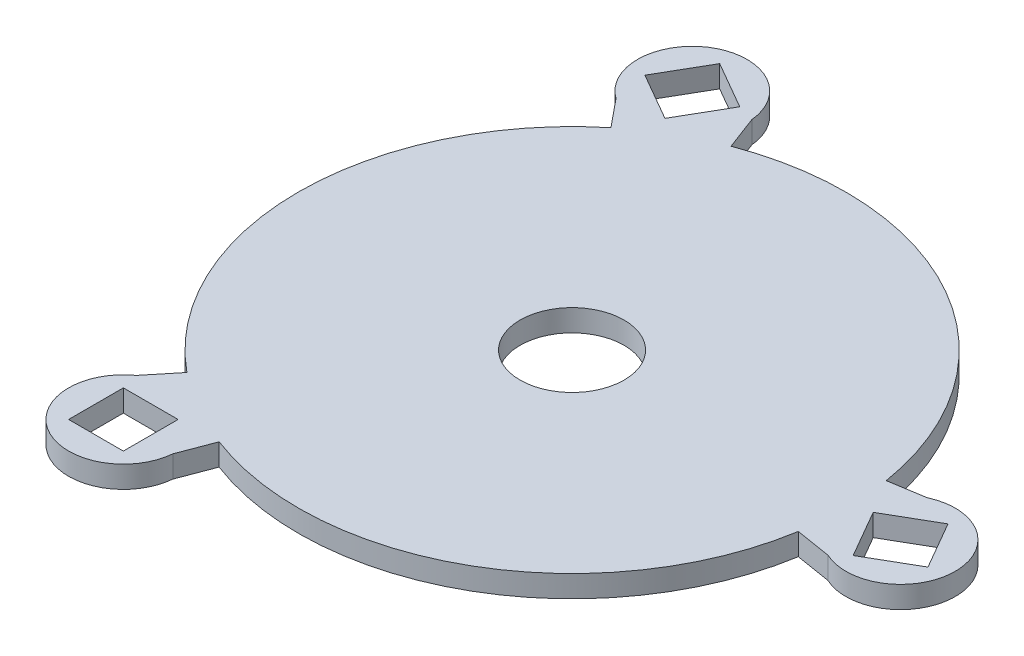
ISO-10303-21;
HEADER;
FILE_DESCRIPTION(('STEP AP214'),'2;1');
FILE_NAME('part.step','',(''),(''),'','','');
FILE_SCHEMA(('AUTOMOTIVE_DESIGN { 1 0 10303 214 1 1 1 1 }'));
ENDSEC;
DATA;
#1=APPLICATION_CONTEXT('core data for automotive mechanical design processes');
#2=APPLICATION_PROTOCOL_DEFINITION('international standard','automotive_design',2000,#1);
#3=PRODUCT_CONTEXT('',#1,'mechanical');
#4=PRODUCT('Part','Part','',(#3));
#5=PRODUCT_RELATED_PRODUCT_CATEGORY('part','',(#4));
#6=PRODUCT_DEFINITION_FORMATION('','',#4);
#7=PRODUCT_DEFINITION_CONTEXT('part definition',#1,'design');
#8=PRODUCT_DEFINITION('design','',#6,#7);
#9=PRODUCT_DEFINITION_SHAPE('','',#8);
#10=(LENGTH_UNIT() NAMED_UNIT(*) SI_UNIT(.MILLI.,.METRE.));
#11=(NAMED_UNIT(*) PLANE_ANGLE_UNIT() SI_UNIT($,.RADIAN.));
#12=(NAMED_UNIT(*) SI_UNIT($,.STERADIAN.) SOLID_ANGLE_UNIT());
#13=UNCERTAINTY_MEASURE_WITH_UNIT(LENGTH_MEASURE(1.E-05),#10,'distance_accuracy_value','');
#14=(GEOMETRIC_REPRESENTATION_CONTEXT(3) GLOBAL_UNCERTAINTY_ASSIGNED_CONTEXT((#13)) GLOBAL_UNIT_ASSIGNED_CONTEXT((#10,
#11,#12)) REPRESENTATION_CONTEXT('',''));
#15=CARTESIAN_POINT('',(0.,0.,0.));
#16=DIRECTION('',(0.,0.,1.));
#17=DIRECTION('',(1.,0.,0.));
#18=AXIS2_PLACEMENT_3D('',#15,#16,#17);
#19=CARTESIAN_POINT('',(-15.,2.,25.9807621135331));
#20=DIRECTION('',(0.,-1.,0.));
#21=DIRECTION('',(0.,0.,-1.));
#22=AXIS2_PLACEMENT_3D('',#19,#20,#21);
#23=CYLINDRICAL_SURFACE('',#22,5.);
#24=CARTESIAN_POINT('',(-15.,0.,25.9807621135331));
#25=DIRECTION('',(0.,1.,0.));
#26=DIRECTION('',(0.,0.,1.));
#27=AXIS2_PLACEMENT_3D('',#24,#25,#26);
#28=CIRCLE('',#27,5.);
#29=CARTESIAN_POINT('',(-17.886625065768,0.,21.8981899182523));
#30=VERTEX_POINT('',#29);
#31=CARTESIAN_POINT('',(-10.0210762332188,0.,26.4393666540487));
#32=VERTEX_POINT('',#31);
#33=EDGE_CURVE('E460',#30,#32,#28,.T.);
#34=ORIENTED_EDGE('',*,*,#33,.T.);
#35=DIRECTION('',(0.,-1.,0.));
#36=VECTOR('',#35,1.);
#37=CARTESIAN_POINT('',(-10.0210762332188,2.,26.4393666540487));
#38=LINE('',#37,#36);
#39=CARTESIAN_POINT('',(-10.0210762332188,2.,26.4393666540487));
#40=VERTEX_POINT('',#39);
#41=EDGE_CURVE('E474',#40,#32,#38,.T.);
#42=ORIENTED_EDGE('',*,*,#41,.F.);
#43=CARTESIAN_POINT('',(-15.,2.,25.9807621135331));
#44=DIRECTION('',(0.,1.,0.));
#45=DIRECTION('',(0.,0.,1.));
#46=AXIS2_PLACEMENT_3D('',#43,#44,#45);
#47=CIRCLE('',#46,5.);
#48=CARTESIAN_POINT('',(-17.886625065768,2.,21.8981899182523));
#49=VERTEX_POINT('',#48);
#50=EDGE_CURVE('E580',#49,#40,#47,.T.);
#51=ORIENTED_EDGE('',*,*,#50,.F.);
#52=DIRECTION('',(0.,-1.,0.));
#53=VECTOR('',#52,1.);
#54=CARTESIAN_POINT('',(-17.886625065768,2.,21.8981899182523));
#55=LINE('',#54,#53);
#56=EDGE_CURVE('E291',#49,#30,#55,.T.);
#57=ORIENTED_EDGE('',*,*,#56,.T.);
#58=EDGE_LOOP('',(#34,#42,#51,#57));
#59=FACE_BOUND('',#58,.T.);
#60=ADVANCED_FACE('F80',(#59),#23,.T.);
#61=CARTESIAN_POINT('',(0.,2.,0.));
#62=DIRECTION('',(0.935087202954627,0.,0.354417723696901));
#63=DIRECTION('',(0.354417723696901,0.,-0.935087202954627));
#64=AXIS2_PLACEMENT_3D('',#61,#62,#63);
#65=PLANE('',#64);
#66=DIRECTION('',(-0.354417723696901,0.,0.935087202954627));
#67=VECTOR('',#66,1.);
#68=CARTESIAN_POINT('',(0.,0.,0.));
#69=LINE('',#68,#67);
#70=CARTESIAN_POINT('',(-8.86044309242252,0.,23.3771800738657));
#71=VERTEX_POINT('',#70);
#72=EDGE_CURVE('E466',#71,#32,#69,.T.);
#73=ORIENTED_EDGE('',*,*,#72,.F.);
#74=DIRECTION('',(0.,-1.,0.));
#75=VECTOR('',#74,1.);
#76=CARTESIAN_POINT('',(-8.86044309242252,2.,23.3771800738657));
#77=LINE('',#76,#75);
#78=CARTESIAN_POINT('',(-8.86044309242252,2.,23.3771800738657));
#79=VERTEX_POINT('',#78);
#80=EDGE_CURVE('E471',#79,#71,#77,.T.);
#81=ORIENTED_EDGE('',*,*,#80,.F.);
#82=DIRECTION('',(-0.354417723696901,0.,0.935087202954627));
#83=VECTOR('',#82,1.);
#84=CARTESIAN_POINT('',(0.,2.,0.));
#85=LINE('',#84,#83);
#86=EDGE_CURVE('E479',#79,#40,#85,.T.);
#87=ORIENTED_EDGE('',*,*,#86,.T.);
#88=ORIENTED_EDGE('',*,*,#41,.T.);
#89=EDGE_LOOP('',(#73,#81,#87,#88));
#90=FACE_BOUND('',#89,.T.);
#91=ADVANCED_FACE('F314',(#90),#65,.T.);
#92=CARTESIAN_POINT('',(0.,2.,0.));
#93=DIRECTION('',(0.774478353750282,0.,0.632600410663993));
#94=DIRECTION('',(0.632600410663993,0.,-0.774478353750282));
#95=AXIS2_PLACEMENT_3D('',#92,#93,#94);
#96=PLANE('',#95);
#97=DIRECTION('',(-0.632600410663993,0.,0.774478353750282));
#98=VECTOR('',#97,1.);
#99=CARTESIAN_POINT('',(0.,0.,0.));
#100=LINE('',#99,#98);
#101=CARTESIAN_POINT('',(-15.8150102665998,0.,19.3619588437571));
#102=VERTEX_POINT('',#101);
#103=EDGE_CURVE('E456',#102,#30,#100,.T.);
#104=ORIENTED_EDGE('',*,*,#103,.T.);
#105=ORIENTED_EDGE('',*,*,#56,.F.);
#106=DIRECTION('',(-0.632600410663993,0.,0.774478353750282));
#107=VECTOR('',#106,1.);
#108=CARTESIAN_POINT('',(0.,2.,0.));
#109=LINE('',#108,#107);
#110=CARTESIAN_POINT('',(-15.8150102665998,2.,19.3619588437571));
#111=VERTEX_POINT('',#110);
#112=EDGE_CURVE('E578',#111,#49,#109,.T.);
#113=ORIENTED_EDGE('',*,*,#112,.F.);
#114=DIRECTION('',(0.,-1.,0.));
#115=VECTOR('',#114,1.);
#116=CARTESIAN_POINT('',(-15.8150102665998,2.,19.3619588437571));
#117=LINE('',#116,#115);
#118=EDGE_CURVE('E97',#111,#102,#117,.T.);
#119=ORIENTED_EDGE('',*,*,#118,.T.);
#120=EDGE_LOOP('',(#104,#105,#113,#119));
#121=FACE_BOUND('',#120,.T.);
#122=ADVANCED_FACE('F320',(#121),#96,.F.);
#123=CARTESIAN_POINT('',(-12.5,2.,0.));
#124=DIRECTION('',(1.,0.,0.));
#125=DIRECTION('',(0.,0.,-1.));
#126=AXIS2_PLACEMENT_3D('',#123,#124,#125);
#127=PLANE('',#126);
#128=DIRECTION('',(0.,0.,1.));
#129=VECTOR('',#128,1.);
#130=CARTESIAN_POINT('',(-12.5,0.,0.));
#131=LINE('',#130,#129);
#132=CARTESIAN_POINT('',(-12.5,0.,23.4807621135331));
#133=VERTEX_POINT('',#132);
#134=CARTESIAN_POINT('',(-12.5,0.,28.4807621135331));
#135=VERTEX_POINT('',#134);
#136=EDGE_CURVE('E443',#133,#135,#131,.T.);
#137=ORIENTED_EDGE('',*,*,#136,.T.);
#138=DIRECTION('',(0.,-1.,0.));
#139=VECTOR('',#138,1.);
#140=CARTESIAN_POINT('',(-12.5,2.,28.4807621135331));
#141=LINE('',#140,#139);
#142=CARTESIAN_POINT('',(-12.5,2.,28.4807621135331));
#143=VERTEX_POINT('',#142);
#144=EDGE_CURVE('E481',#143,#135,#141,.T.);
#145=ORIENTED_EDGE('',*,*,#144,.F.);
#146=DIRECTION('',(0.,0.,1.));
#147=VECTOR('',#146,1.);
#148=CARTESIAN_POINT('',(-12.5,2.,0.));
#149=LINE('',#148,#147);
#150=CARTESIAN_POINT('',(-12.5,2.,23.4807621135331));
#151=VERTEX_POINT('',#150);
#152=EDGE_CURVE('E599',#151,#143,#149,.T.);
#153=ORIENTED_EDGE('',*,*,#152,.F.);
#154=DIRECTION('',(0.,-1.,0.));
#155=VECTOR('',#154,1.);
#156=CARTESIAN_POINT('',(-12.5,2.,23.4807621135331));
#157=LINE('',#156,#155);
#158=EDGE_CURVE('E472',#151,#133,#157,.T.);
#159=ORIENTED_EDGE('',*,*,#158,.T.);
#160=EDGE_LOOP('',(#137,#145,#153,#159));
#161=FACE_BOUND('',#160,.T.);
#162=ADVANCED_FACE('F328',(#161),#127,.F.);
#163=CARTESIAN_POINT('',(0.,2.,28.4807621135331));
#164=DIRECTION('',(0.,0.,-1.));
#165=DIRECTION('',(-1.,0.,0.));
#166=AXIS2_PLACEMENT_3D('',#163,#164,#165);
#167=PLANE('',#166);
#168=DIRECTION('',(1.,0.,0.));
#169=VECTOR('',#168,1.);
#170=CARTESIAN_POINT('',(0.,0.,28.4807621135331));
#171=LINE('',#170,#169);
#172=CARTESIAN_POINT('',(-17.5,0.,28.4807621135331));
#173=VERTEX_POINT('',#172);
#174=EDGE_CURVE('E457',#173,#135,#171,.T.);
#175=ORIENTED_EDGE('',*,*,#174,.F.);
#176=DIRECTION('',(0.,-1.,0.));
#177=VECTOR('',#176,1.);
#178=CARTESIAN_POINT('',(-17.5,2.,28.4807621135331));
#179=LINE('',#178,#177);
#180=CARTESIAN_POINT('',(-17.5,2.,28.4807621135331));
#181=VERTEX_POINT('',#180);
#182=EDGE_CURVE('E454',#181,#173,#179,.T.);
#183=ORIENTED_EDGE('',*,*,#182,.F.);
#184=DIRECTION('',(1.,0.,0.));
#185=VECTOR('',#184,1.);
#186=CARTESIAN_POINT('',(0.,2.,28.4807621135331));
#187=LINE('',#186,#185);
#188=EDGE_CURVE('E584',#181,#143,#187,.T.);
#189=ORIENTED_EDGE('',*,*,#188,.T.);
#190=ORIENTED_EDGE('',*,*,#144,.T.);
#191=EDGE_LOOP('',(#175,#183,#189,#190));
#192=FACE_BOUND('',#191,.T.);
#193=ADVANCED_FACE('F334',(#192),#167,.T.);
#194=CARTESIAN_POINT('',(-17.5,2.,0.));
#195=DIRECTION('',(1.,0.,0.));
#196=DIRECTION('',(0.,0.,-1.));
#197=AXIS2_PLACEMENT_3D('',#194,#195,#196);
#198=PLANE('',#197);
#199=DIRECTION('',(0.,0.,1.));
#200=VECTOR('',#199,1.);
#201=CARTESIAN_POINT('',(-17.5,0.,0.));
#202=LINE('',#201,#200);
#203=CARTESIAN_POINT('',(-17.5,0.,23.4807621135331));
#204=VERTEX_POINT('',#203);
#205=EDGE_CURVE('E441',#204,#173,#202,.T.);
#206=ORIENTED_EDGE('',*,*,#205,.F.);
#207=DIRECTION('',(0.,-1.,0.));
#208=VECTOR('',#207,1.);
#209=CARTESIAN_POINT('',(-17.5,2.,23.4807621135331));
#210=LINE('',#209,#208);
#211=CARTESIAN_POINT('',(-17.5,2.,23.4807621135331));
#212=VERTEX_POINT('',#211);
#213=EDGE_CURVE('E451',#212,#204,#210,.T.);
#214=ORIENTED_EDGE('',*,*,#213,.F.);
#215=DIRECTION('',(0.,0.,1.));
#216=VECTOR('',#215,1.);
#217=CARTESIAN_POINT('',(-17.5,2.,0.));
#218=LINE('',#217,#216);
#219=EDGE_CURVE('E581',#212,#181,#218,.T.);
#220=ORIENTED_EDGE('',*,*,#219,.T.);
#221=ORIENTED_EDGE('',*,*,#182,.T.);
#222=EDGE_LOOP('',(#206,#214,#220,#221));
#223=FACE_BOUND('',#222,.T.);
#224=ADVANCED_FACE('F330',(#223),#198,.T.);
#225=CARTESIAN_POINT('',(0.,2.,23.4807621135331));
#226=DIRECTION('',(0.,0.,-1.));
#227=DIRECTION('',(-1.,0.,0.));
#228=AXIS2_PLACEMENT_3D('',#225,#226,#227);
#229=PLANE('',#228);
#230=DIRECTION('',(1.,0.,0.));
#231=VECTOR('',#230,1.);
#232=CARTESIAN_POINT('',(0.,0.,23.4807621135331));
#233=LINE('',#232,#231);
#234=EDGE_CURVE('E438',#204,#133,#233,.T.);
#235=ORIENTED_EDGE('',*,*,#234,.T.);
#236=ORIENTED_EDGE('',*,*,#158,.F.);
#237=DIRECTION('',(1.,0.,0.));
#238=VECTOR('',#237,1.);
#239=CARTESIAN_POINT('',(0.,2.,23.4807621135331));
#240=LINE('',#239,#238);
#241=EDGE_CURVE('E469',#212,#151,#240,.T.);
#242=ORIENTED_EDGE('',*,*,#241,.F.);
#243=ORIENTED_EDGE('',*,*,#213,.T.);
#244=EDGE_LOOP('',(#235,#236,#242,#243));
#245=FACE_BOUND('',#244,.T.);
#246=ADVANCED_FACE('F333',(#245),#229,.F.);
#247=CARTESIAN_POINT('',(0.,0.,0.));
#248=DIRECTION('',(0.,1.,0.));
#249=DIRECTION('',(0.,0.,1.));
#250=AXIS2_PLACEMENT_3D('',#247,#248,#249);
#251=PLANE('',#250);
#252=CARTESIAN_POINT('',(17.5,0.,-8.));
#253=DIRECTION('',(0.,1.,0.));
#254=DIRECTION('',(0.,0.,1.));
#255=AXIS2_PLACEMENT_3D('',#252,#253,#254);
#256=CIRCLE('',#255,1.9);
#257=CARTESIAN_POINT('',(17.5,0.,-6.1));
#258=VERTEX_POINT('',#257);
#259=EDGE_CURVE('E290',#258,#258,#256,.F.);
#260=ORIENTED_EDGE('',*,*,#259,.F.);
#261=EDGE_LOOP('',(#260));
#262=FACE_BOUND('',#261,.T.);
#263=CARTESIAN_POINT('',(-17.5,0.,-8.));
#264=DIRECTION('',(0.,1.,0.));
#265=DIRECTION('',(0.,0.,1.));
#266=AXIS2_PLACEMENT_3D('',#263,#264,#265);
#267=CIRCLE('',#266,1.9);
#268=CARTESIAN_POINT('',(-17.5,0.,-6.1));
#269=VERTEX_POINT('',#268);
#270=EDGE_CURVE('E287',#269,#269,#267,.F.);
#271=ORIENTED_EDGE('',*,*,#270,.F.);
#272=EDGE_LOOP('',(#271));
#273=FACE_BOUND('',#272,.T.);
#274=CARTESIAN_POINT('',(0.,0.,0.));
#275=DIRECTION('',(0.,-1.,0.));
#276=DIRECTION('',(0.,0.,-1.));
#277=AXIS2_PLACEMENT_3D('',#274,#275,#276);
#278=CIRCLE('',#277,4.75);
#279=CARTESIAN_POINT('',(0.,0.,-4.75));
#280=VERTEX_POINT('',#279);
#281=EDGE_CURVE('E237',#280,#280,#278,.T.);
#282=ORIENTED_EDGE('',*,*,#281,.F.);
#283=EDGE_LOOP('',(#282));
#284=FACE_BOUND('',#283,.T.);
#285=ORIENTED_EDGE('',*,*,#234,.F.);
#286=ORIENTED_EDGE('',*,*,#205,.T.);
#287=ORIENTED_EDGE('',*,*,#174,.T.);
#288=ORIENTED_EDGE('',*,*,#136,.F.);
#289=EDGE_LOOP('',(#285,#286,#287,#288));
#290=FACE_BOUND('',#289,.T.);
#291=ORIENTED_EDGE('',*,*,#103,.F.);
#292=CARTESIAN_POINT('',(0.,0.,0.));
#293=DIRECTION('',(0.,1.,0.));
#294=DIRECTION('',(0.,0.,1.));
#295=AXIS2_PLACEMENT_3D('',#292,#293,#294);
#296=CIRCLE('',#295,25.);
#297=CARTESIAN_POINT('',(-15.8150102665998,0.,-19.3619588437571));
#298=VERTEX_POINT('',#297);
#299=EDGE_CURVE('E239',#298,#102,#296,.T.);
#300=ORIENTED_EDGE('',*,*,#299,.F.);
#301=DIRECTION('',(-0.632600410663992,0.,-0.774478353750283));
#302=VECTOR('',#301,1.);
#303=CARTESIAN_POINT('',(0.,0.,0.));
#304=LINE('',#303,#302);
#305=CARTESIAN_POINT('',(-17.886625065768,0.,-21.8981899182524));
#306=VERTEX_POINT('',#305);
#307=EDGE_CURVE('E258',#298,#306,#304,.T.);
#308=ORIENTED_EDGE('',*,*,#307,.T.);
#309=CARTESIAN_POINT('',(-15.,0.,-25.9807621135332));
#310=DIRECTION('',(0.,1.,0.));
#311=DIRECTION('',(0.,0.,1.));
#312=AXIS2_PLACEMENT_3D('',#309,#310,#311);
#313=CIRCLE('',#312,5.);
#314=CARTESIAN_POINT('',(-10.0210762332188,0.,-26.4393666540488));
#315=VERTEX_POINT('',#314);
#316=EDGE_CURVE('E254',#315,#306,#313,.T.);
#317=ORIENTED_EDGE('',*,*,#316,.F.);
#318=DIRECTION('',(-0.354417723696899,0.,-0.935087202954627));
#319=VECTOR('',#318,1.);
#320=CARTESIAN_POINT('',(0.,0.,0.));
#321=LINE('',#320,#319);
#322=CARTESIAN_POINT('',(-8.86044309242248,0.,-23.3771800738657));
#323=VERTEX_POINT('',#322);
#324=EDGE_CURVE('E244',#323,#315,#321,.T.);
#325=ORIENTED_EDGE('',*,*,#324,.F.);
#326=CARTESIAN_POINT('',(24.6754533590223,0.,-4.01522123010859));
#327=VERTEX_POINT('',#326);
#328=EDGE_CURVE('E225',#327,#323,#296,.T.);
#329=ORIENTED_EDGE('',*,*,#328,.F.);
#330=DIRECTION('',(0.987018134360892,0.,-0.160608849204344));
#331=VECTOR('',#330,1.);
#332=CARTESIAN_POINT('',(0.,0.,0.));
#333=LINE('',#332,#331);
#334=CARTESIAN_POINT('',(27.9077012989868,0.,-4.54117673579639));
#335=VERTEX_POINT('',#334);
#336=EDGE_CURVE('E488',#327,#335,#333,.T.);
#337=ORIENTED_EDGE('',*,*,#336,.T.);
#338=CARTESIAN_POINT('',(30.,0.,0.));
#339=DIRECTION('',(0.,1.,0.));
#340=DIRECTION('',(0.,0.,1.));
#341=AXIS2_PLACEMENT_3D('',#338,#339,#340);
#342=CIRCLE('',#341,5.);
#343=CARTESIAN_POINT('',(27.9077012989868,0.,4.54117673579642));
#344=VERTEX_POINT('',#343);
#345=EDGE_CURVE('E519',#344,#335,#342,.T.);
#346=ORIENTED_EDGE('',*,*,#345,.F.);
#347=DIRECTION('',(0.987018134360892,0.,0.160608849204345));
#348=VECTOR('',#347,1.);
#349=CARTESIAN_POINT('',(0.,0.,0.));
#350=LINE('',#349,#348);
#351=CARTESIAN_POINT('',(24.6754533590223,0.,4.01522123010862));
#352=VERTEX_POINT('',#351);
#353=EDGE_CURVE('E516',#352,#344,#350,.T.);
#354=ORIENTED_EDGE('',*,*,#353,.F.);
#355=EDGE_CURVE('E236',#71,#352,#296,.T.);
#356=ORIENTED_EDGE('',*,*,#355,.F.);
#357=ORIENTED_EDGE('',*,*,#72,.T.);
#358=ORIENTED_EDGE('',*,*,#33,.F.);
#359=EDGE_LOOP('',(#291,#300,#308,#317,#325,#329,#337,#346,#354,#356,#357,#358));
#360=FACE_BOUND('',#359,.T.);
#361=DIRECTION('',(-0.5,0.,-0.866025403784439));
#362=VECTOR('',#361,1.);
#363=CARTESIAN_POINT('',(20.3349364905389,0.,-11.7403810567666));
#364=LINE('',#363,#362);
#365=CARTESIAN_POINT('',(29.0849364905389,0.,3.41506350946112));
#366=VERTEX_POINT('',#365);
#367=CARTESIAN_POINT('',(26.5849364905389,0.,-0.915063509461068));
#368=VERTEX_POINT('',#367);
#369=EDGE_CURVE('E272',#366,#368,#364,.T.);
#370=ORIENTED_EDGE('',*,*,#369,.F.);
#371=DIRECTION('',(0.866025403784438,0.,-0.5));
#372=VECTOR('',#371,1.);
#373=CARTESIAN_POINT('',(8.75000000000002,0.,15.1554445662277));
#374=LINE('',#373,#372);
#375=CARTESIAN_POINT('',(33.4150635094611,0.,0.915063509461118));
#376=VERTEX_POINT('',#375);
#377=EDGE_CURVE('E513',#366,#376,#374,.T.);
#378=ORIENTED_EDGE('',*,*,#377,.T.);
#379=DIRECTION('',(-0.500000000000001,0.,-0.866025403784438));
#380=VECTOR('',#379,1.);
#381=CARTESIAN_POINT('',(24.6650635094611,0.,-14.2403810567666));
#382=LINE('',#381,#380);
#383=CARTESIAN_POINT('',(30.9150635094611,0.,-3.41506350946107));
#384=VERTEX_POINT('',#383);
#385=EDGE_CURVE('E510',#376,#384,#382,.T.);
#386=ORIENTED_EDGE('',*,*,#385,.T.);
#387=DIRECTION('',(0.866025403784438,0.,-0.5));
#388=VECTOR('',#387,1.);
#389=CARTESIAN_POINT('',(6.25000000000002,0.,10.8253175473055));
#390=LINE('',#389,#388);
#391=EDGE_CURVE('E507',#368,#384,#390,.T.);
#392=ORIENTED_EDGE('',*,*,#391,.F.);
#393=EDGE_LOOP('',(#370,#378,#386,#392));
#394=FACE_BOUND('',#393,.T.);
#395=DIRECTION('',(-0.5,0.,0.866025403784439));
#396=VECTOR('',#395,1.);
#397=CARTESIAN_POINT('',(-20.3349364905389,0.,-11.7403810567666));
#398=LINE('',#397,#396);
#399=CARTESIAN_POINT('',(-11.5849364905389,0.,-26.8958256229943));
#400=VERTEX_POINT('',#399);
#401=CARTESIAN_POINT('',(-14.0849364905389,0.,-22.5656986040721));
#402=VERTEX_POINT('',#401);
#403=EDGE_CURVE('E283',#400,#402,#398,.T.);
#404=ORIENTED_EDGE('',*,*,#403,.F.);
#405=DIRECTION('',(-0.866025403784439,0.,-0.5));
#406=VECTOR('',#405,1.);
#407=CARTESIAN_POINT('',(8.75000000000001,0.,-15.1554445662277));
#408=LINE('',#407,#406);
#409=CARTESIAN_POINT('',(-15.9150635094611,0.,-29.3958256229943));
#410=VERTEX_POINT('',#409);
#411=EDGE_CURVE('E256',#400,#410,#408,.T.);
#412=ORIENTED_EDGE('',*,*,#411,.T.);
#413=DIRECTION('',(-0.5,0.,0.866025403784439));
#414=VECTOR('',#413,1.);
#415=CARTESIAN_POINT('',(-24.6650635094611,0.,-14.2403810567666));
#416=LINE('',#415,#414);
#417=CARTESIAN_POINT('',(-18.4150635094611,0.,-25.0656986040721));
#418=VERTEX_POINT('',#417);
#419=EDGE_CURVE('E261',#410,#418,#416,.T.);
#420=ORIENTED_EDGE('',*,*,#419,.T.);
#421=DIRECTION('',(-0.866025403784439,0.,-0.499999999999999));
#422=VECTOR('',#421,1.);
#423=CARTESIAN_POINT('',(6.25000000000002,0.,-10.8253175473055));
#424=LINE('',#423,#422);
#425=EDGE_CURVE('E556',#402,#418,#424,.T.);
#426=ORIENTED_EDGE('',*,*,#425,.F.);
#427=EDGE_LOOP('',(#404,#412,#420,#426));
#428=FACE_BOUND('',#427,.T.);
#429=ADVANCED_FACE('F250',(#262,#273,#284,#290,#360,#394,#428),#251,.F.);
#430=CARTESIAN_POINT('',(0.,2.,0.));
#431=DIRECTION('',(0.,1.,0.));
#432=DIRECTION('',(0.,0.,1.));
#433=AXIS2_PLACEMENT_3D('',#430,#431,#432);
#434=PLANE('',#433);
#435=CARTESIAN_POINT('',(0.,2.,0.));
#436=DIRECTION('',(0.,1.,0.));
#437=DIRECTION('',(0.,0.,1.));
#438=AXIS2_PLACEMENT_3D('',#435,#436,#437);
#439=CIRCLE('',#438,4.75);
#440=CARTESIAN_POINT('',(0.,2.,4.75));
#441=VERTEX_POINT('',#440);
#442=EDGE_CURVE('E604',#441,#441,#439,.F.);
#443=ORIENTED_EDGE('',*,*,#442,.T.);
#444=EDGE_LOOP('',(#443));
#445=FACE_BOUND('',#444,.T.);
#446=ORIENTED_EDGE('',*,*,#241,.T.);
#447=ORIENTED_EDGE('',*,*,#152,.T.);
#448=ORIENTED_EDGE('',*,*,#188,.F.);
#449=ORIENTED_EDGE('',*,*,#219,.F.);
#450=EDGE_LOOP('',(#446,#447,#448,#449));
#451=FACE_BOUND('',#450,.T.);
#452=ORIENTED_EDGE('',*,*,#112,.T.);
#453=ORIENTED_EDGE('',*,*,#50,.T.);
#454=ORIENTED_EDGE('',*,*,#86,.F.);
#455=CARTESIAN_POINT('',(0.,2.,0.));
#456=DIRECTION('',(0.,1.,0.));
#457=DIRECTION('',(0.,0.,1.));
#458=AXIS2_PLACEMENT_3D('',#455,#456,#457);
#459=CIRCLE('',#458,25.);
#460=CARTESIAN_POINT('',(24.6754533590223,2.,4.01522123010862));
#461=VERTEX_POINT('',#460);
#462=EDGE_CURVE('E284',#79,#461,#459,.T.);
#463=ORIENTED_EDGE('',*,*,#462,.T.);
#464=DIRECTION('',(0.987018134360892,0.,0.160608849204345));
#465=VECTOR('',#464,1.);
#466=CARTESIAN_POINT('',(0.,2.,0.));
#467=LINE('',#466,#465);
#468=CARTESIAN_POINT('',(27.9077012989868,2.,4.54117673579642));
#469=VERTEX_POINT('',#468);
#470=EDGE_CURVE('E496',#461,#469,#467,.T.);
#471=ORIENTED_EDGE('',*,*,#470,.T.);
#472=CARTESIAN_POINT('',(30.,2.,0.));
#473=DIRECTION('',(0.,1.,0.));
#474=DIRECTION('',(0.,0.,1.));
#475=AXIS2_PLACEMENT_3D('',#472,#473,#474);
#476=CIRCLE('',#475,5.);
#477=CARTESIAN_POINT('',(27.9077012989868,2.,-4.54117673579639));
#478=VERTEX_POINT('',#477);
#479=EDGE_CURVE('E499',#469,#478,#476,.T.);
#480=ORIENTED_EDGE('',*,*,#479,.T.);
#481=DIRECTION('',(0.987018134360892,0.,-0.160608849204344));
#482=VECTOR('',#481,1.);
#483=CARTESIAN_POINT('',(0.,2.,0.));
#484=LINE('',#483,#482);
#485=CARTESIAN_POINT('',(24.6754533590223,2.,-4.01522123010859));
#486=VERTEX_POINT('',#485);
#487=EDGE_CURVE('E501',#486,#478,#484,.T.);
#488=ORIENTED_EDGE('',*,*,#487,.F.);
#489=CARTESIAN_POINT('',(-8.86044309242248,2.,-23.3771800738657));
#490=VERTEX_POINT('',#489);
#491=EDGE_CURVE('E285',#486,#490,#459,.T.);
#492=ORIENTED_EDGE('',*,*,#491,.T.);
#493=DIRECTION('',(-0.354417723696899,0.,-0.935087202954627));
#494=VECTOR('',#493,1.);
#495=CARTESIAN_POINT('',(0.,2.,0.));
#496=LINE('',#495,#494);
#497=CARTESIAN_POINT('',(-10.0210762332188,2.,-26.4393666540488));
#498=VERTEX_POINT('',#497);
#499=EDGE_CURVE('E246',#490,#498,#496,.T.);
#500=ORIENTED_EDGE('',*,*,#499,.T.);
#501=CARTESIAN_POINT('',(-15.,2.,-25.9807621135332));
#502=DIRECTION('',(0.,1.,0.));
#503=DIRECTION('',(0.,0.,1.));
#504=AXIS2_PLACEMENT_3D('',#501,#502,#503);
#505=CIRCLE('',#504,5.);
#506=CARTESIAN_POINT('',(-17.886625065768,2.,-21.8981899182524));
#507=VERTEX_POINT('',#506);
#508=EDGE_CURVE('E550',#498,#507,#505,.T.);
#509=ORIENTED_EDGE('',*,*,#508,.T.);
#510=DIRECTION('',(-0.632600410663992,0.,-0.774478353750283));
#511=VECTOR('',#510,1.);
#512=CARTESIAN_POINT('',(0.,2.,0.));
#513=LINE('',#512,#511);
#514=CARTESIAN_POINT('',(-15.8150102665998,2.,-19.3619588437571));
#515=VERTEX_POINT('',#514);
#516=EDGE_CURVE('E276',#515,#507,#513,.T.);
#517=ORIENTED_EDGE('',*,*,#516,.F.);
#518=EDGE_CURVE('E282',#515,#111,#459,.T.);
#519=ORIENTED_EDGE('',*,*,#518,.T.);
#520=EDGE_LOOP('',(#452,#453,#454,#463,#471,#480,#488,#492,#500,#509,#517,#519));
#521=FACE_BOUND('',#520,.T.);
#522=DIRECTION('',(-0.5,0.,-0.866025403784439));
#523=VECTOR('',#522,1.);
#524=CARTESIAN_POINT('',(20.3349364905389,2.,-11.7403810567666));
#525=LINE('',#524,#523);
#526=CARTESIAN_POINT('',(29.0849364905389,2.,3.41506350946112));
#527=VERTEX_POINT('',#526);
#528=CARTESIAN_POINT('',(26.5849364905389,2.,-0.915063509461068));
#529=VERTEX_POINT('',#528);
#530=EDGE_CURVE('E484',#527,#529,#525,.T.);
#531=ORIENTED_EDGE('',*,*,#530,.T.);
#532=DIRECTION('',(0.866025403784438,0.,-0.5));
#533=VECTOR('',#532,1.);
#534=CARTESIAN_POINT('',(6.25000000000002,2.,10.8253175473055));
#535=LINE('',#534,#533);
#536=CARTESIAN_POINT('',(30.9150635094611,2.,-3.41506350946107));
#537=VERTEX_POINT('',#536);
#538=EDGE_CURVE('E487',#529,#537,#535,.T.);
#539=ORIENTED_EDGE('',*,*,#538,.T.);
#540=DIRECTION('',(-0.500000000000001,0.,-0.866025403784438));
#541=VECTOR('',#540,1.);
#542=CARTESIAN_POINT('',(24.6650635094611,2.,-14.2403810567666));
#543=LINE('',#542,#541);
#544=CARTESIAN_POINT('',(33.4150635094611,2.,0.915063509461118));
#545=VERTEX_POINT('',#544);
#546=EDGE_CURVE('E490',#545,#537,#543,.T.);
#547=ORIENTED_EDGE('',*,*,#546,.F.);
#548=DIRECTION('',(0.866025403784438,0.,-0.5));
#549=VECTOR('',#548,1.);
#550=CARTESIAN_POINT('',(8.75000000000002,2.,15.1554445662277));
#551=LINE('',#550,#549);
#552=EDGE_CURVE('E493',#527,#545,#551,.T.);
#553=ORIENTED_EDGE('',*,*,#552,.F.);
#554=EDGE_LOOP('',(#531,#539,#547,#553));
#555=FACE_BOUND('',#554,.T.);
#556=DIRECTION('',(-0.5,0.,0.866025403784439));
#557=VECTOR('',#556,1.);
#558=CARTESIAN_POINT('',(-20.3349364905389,2.,-11.7403810567666));
#559=LINE('',#558,#557);
#560=CARTESIAN_POINT('',(-11.5849364905389,2.,-26.8958256229943));
#561=VERTEX_POINT('',#560);
#562=CARTESIAN_POINT('',(-14.0849364905389,2.,-22.5656986040721));
#563=VERTEX_POINT('',#562);
#564=EDGE_CURVE('E265',#561,#563,#559,.T.);
#565=ORIENTED_EDGE('',*,*,#564,.T.);
#566=DIRECTION('',(-0.866025403784439,0.,-0.499999999999999));
#567=VECTOR('',#566,1.);
#568=CARTESIAN_POINT('',(6.25000000000002,2.,-10.8253175473055));
#569=LINE('',#568,#567);
#570=CARTESIAN_POINT('',(-18.4150635094611,2.,-25.0656986040721));
#571=VERTEX_POINT('',#570);
#572=EDGE_CURVE('E541',#563,#571,#569,.T.);
#573=ORIENTED_EDGE('',*,*,#572,.T.);
#574=DIRECTION('',(-0.5,0.,0.866025403784439));
#575=VECTOR('',#574,1.);
#576=CARTESIAN_POINT('',(-24.6650635094611,2.,-14.2403810567666));
#577=LINE('',#576,#575);
#578=CARTESIAN_POINT('',(-15.9150635094611,2.,-29.3958256229943));
#579=VERTEX_POINT('',#578);
#580=EDGE_CURVE('E543',#579,#571,#577,.T.);
#581=ORIENTED_EDGE('',*,*,#580,.F.);
#582=DIRECTION('',(-0.866025403784439,0.,-0.5));
#583=VECTOR('',#582,1.);
#584=CARTESIAN_POINT('',(8.75000000000001,2.,-15.1554445662277));
#585=LINE('',#584,#583);
#586=EDGE_CURVE('E546',#561,#579,#585,.T.);
#587=ORIENTED_EDGE('',*,*,#586,.F.);
#588=EDGE_LOOP('',(#565,#573,#581,#587));
#589=FACE_BOUND('',#588,.T.);
#590=ADVANCED_FACE('F356',(#445,#451,#521,#555,#589),#434,.T.);
#591=CARTESIAN_POINT('',(30.,2.,0.));
#592=DIRECTION('',(0.,-1.,0.));
#593=DIRECTION('',(0.,0.,-1.));
#594=AXIS2_PLACEMENT_3D('',#591,#592,#593);
#595=CYLINDRICAL_SURFACE('',#594,5.);
#596=ORIENTED_EDGE('',*,*,#345,.T.);
#597=DIRECTION('',(0.,-1.,0.));
#598=VECTOR('',#597,1.);
#599=CARTESIAN_POINT('',(27.9077012989868,2.,-4.54117673579639));
#600=LINE('',#599,#598);
#601=EDGE_CURVE('E528',#478,#335,#600,.T.);
#602=ORIENTED_EDGE('',*,*,#601,.F.);
#603=ORIENTED_EDGE('',*,*,#479,.F.);
#604=DIRECTION('',(0.,-1.,0.));
#605=VECTOR('',#604,1.);
#606=CARTESIAN_POINT('',(27.9077012989868,2.,4.54117673579642));
#607=LINE('',#606,#605);
#608=EDGE_CURVE('E446',#469,#344,#607,.T.);
#609=ORIENTED_EDGE('',*,*,#608,.T.);
#610=EDGE_LOOP('',(#596,#602,#603,#609));
#611=FACE_BOUND('',#610,.T.);
#612=ADVANCED_FACE('F352',(#611),#595,.T.);
#613=CARTESIAN_POINT('',(6.25000000000002,2.,10.8253175473055));
#614=DIRECTION('',(-0.5,0.,-0.866025403784438));
#615=DIRECTION('',(-0.866025403784438,0.,0.5));
#616=AXIS2_PLACEMENT_3D('',#613,#614,#615);
#617=PLANE('',#616);
#618=ORIENTED_EDGE('',*,*,#391,.T.);
#619=DIRECTION('',(0.,-1.,0.));
#620=VECTOR('',#619,1.);
#621=CARTESIAN_POINT('',(30.9150635094611,2.,-3.41506350946107));
#622=LINE('',#621,#620);
#623=EDGE_CURVE('E535',#537,#384,#622,.T.);
#624=ORIENTED_EDGE('',*,*,#623,.F.);
#625=ORIENTED_EDGE('',*,*,#538,.F.);
#626=DIRECTION('',(0.,-1.,0.));
#627=VECTOR('',#626,1.);
#628=CARTESIAN_POINT('',(26.5849364905389,2.,-0.915063509461068));
#629=LINE('',#628,#627);
#630=EDGE_CURVE('E526',#529,#368,#629,.T.);
#631=ORIENTED_EDGE('',*,*,#630,.T.);
#632=EDGE_LOOP('',(#618,#624,#625,#631));
#633=FACE_BOUND('',#632,.T.);
#634=ADVANCED_FACE('F355',(#633),#617,.F.);
#635=CARTESIAN_POINT('',(24.6650635094611,2.,-14.2403810567666));
#636=DIRECTION('',(-0.866025403784438,0.,0.500000000000001));
#637=DIRECTION('',(0.500000000000001,0.,0.866025403784438));
#638=AXIS2_PLACEMENT_3D('',#635,#636,#637);
#639=PLANE('',#638);
#640=ORIENTED_EDGE('',*,*,#385,.F.);
#641=DIRECTION('',(0.,-1.,0.));
#642=VECTOR('',#641,1.);
#643=CARTESIAN_POINT('',(33.4150635094611,2.,0.915063509461118));
#644=LINE('',#643,#642);
#645=EDGE_CURVE('E533',#545,#376,#644,.T.);
#646=ORIENTED_EDGE('',*,*,#645,.F.);
#647=ORIENTED_EDGE('',*,*,#546,.T.);
#648=ORIENTED_EDGE('',*,*,#623,.T.);
#649=EDGE_LOOP('',(#640,#646,#647,#648));
#650=FACE_BOUND('',#649,.T.);
#651=ADVANCED_FACE('F367',(#650),#639,.T.);
#652=CARTESIAN_POINT('',(8.75000000000002,2.,15.1554445662277));
#653=DIRECTION('',(-0.5,0.,-0.866025403784438));
#654=DIRECTION('',(-0.866025403784438,0.,0.5));
#655=AXIS2_PLACEMENT_3D('',#652,#653,#654);
#656=PLANE('',#655);
#657=ORIENTED_EDGE('',*,*,#377,.F.);
#658=DIRECTION('',(0.,-1.,0.));
#659=VECTOR('',#658,1.);
#660=CARTESIAN_POINT('',(29.0849364905389,2.,3.41506350946112));
#661=LINE('',#660,#659);
#662=EDGE_CURVE('E504',#527,#366,#661,.T.);
#663=ORIENTED_EDGE('',*,*,#662,.F.);
#664=ORIENTED_EDGE('',*,*,#552,.T.);
#665=ORIENTED_EDGE('',*,*,#645,.T.);
#666=EDGE_LOOP('',(#657,#663,#664,#665));
#667=FACE_BOUND('',#666,.T.);
#668=ADVANCED_FACE('F364',(#667),#656,.T.);
#669=CARTESIAN_POINT('',(20.3349364905389,2.,-11.7403810567666));
#670=DIRECTION('',(-0.866025403784439,0.,0.5));
#671=DIRECTION('',(0.5,0.,0.866025403784439));
#672=AXIS2_PLACEMENT_3D('',#669,#670,#671);
#673=PLANE('',#672);
#674=ORIENTED_EDGE('',*,*,#369,.T.);
#675=ORIENTED_EDGE('',*,*,#630,.F.);
#676=ORIENTED_EDGE('',*,*,#530,.F.);
#677=ORIENTED_EDGE('',*,*,#662,.T.);
#678=EDGE_LOOP('',(#674,#675,#676,#677));
#679=FACE_BOUND('',#678,.T.);
#680=ADVANCED_FACE('F349',(#679),#673,.F.);
#681=CARTESIAN_POINT('',(0.,2.,0.));
#682=DIRECTION('',(-0.160608849204344,0.,-0.987018134360892));
#683=DIRECTION('',(-0.987018134360892,0.,0.160608849204344));
#684=AXIS2_PLACEMENT_3D('',#681,#682,#683);
#685=PLANE('',#684);
#686=ORIENTED_EDGE('',*,*,#336,.F.);
#687=DIRECTION('',(0.,-1.,0.));
#688=VECTOR('',#687,1.);
#689=CARTESIAN_POINT('',(24.6754533590223,2.,-4.01522123010859));
#690=LINE('',#689,#688);
#691=EDGE_CURVE('E231',#486,#327,#690,.T.);
#692=ORIENTED_EDGE('',*,*,#691,.F.);
#693=ORIENTED_EDGE('',*,*,#487,.T.);
#694=ORIENTED_EDGE('',*,*,#601,.T.);
#695=EDGE_LOOP('',(#686,#692,#693,#694));
#696=FACE_BOUND('',#695,.T.);
#697=ADVANCED_FACE('F345',(#696),#685,.T.);
#698=CARTESIAN_POINT('',(-15.,2.,-25.9807621135332));
#699=DIRECTION('',(0.,-1.,0.));
#700=DIRECTION('',(0.,0.,-1.));
#701=AXIS2_PLACEMENT_3D('',#698,#699,#700);
#702=CYLINDRICAL_SURFACE('',#701,5.);
#703=ORIENTED_EDGE('',*,*,#316,.T.);
#704=DIRECTION('',(0.,-1.,0.));
#705=VECTOR('',#704,1.);
#706=CARTESIAN_POINT('',(-17.886625065768,2.,-21.8981899182524));
#707=LINE('',#706,#705);
#708=EDGE_CURVE('E268',#507,#306,#707,.T.);
#709=ORIENTED_EDGE('',*,*,#708,.F.);
#710=ORIENTED_EDGE('',*,*,#508,.F.);
#711=DIRECTION('',(0.,-1.,0.));
#712=VECTOR('',#711,1.);
#713=CARTESIAN_POINT('',(-10.0210762332188,2.,-26.4393666540488));
#714=LINE('',#713,#712);
#715=EDGE_CURVE('E270',#498,#315,#714,.T.);
#716=ORIENTED_EDGE('',*,*,#715,.T.);
#717=EDGE_LOOP('',(#703,#709,#710,#716));
#718=FACE_BOUND('',#717,.T.);
#719=ADVANCED_FACE('F348',(#718),#702,.T.);
#720=CARTESIAN_POINT('',(0.,2.,0.));
#721=DIRECTION('',(-0.935087202954627,0.,0.354417723696899));
#722=DIRECTION('',(0.354417723696899,0.,0.935087202954627));
#723=AXIS2_PLACEMENT_3D('',#720,#721,#722);
#724=PLANE('',#723);
#725=ORIENTED_EDGE('',*,*,#324,.T.);
#726=ORIENTED_EDGE('',*,*,#715,.F.);
#727=ORIENTED_EDGE('',*,*,#499,.F.);
#728=DIRECTION('',(0.,-1.,0.));
#729=VECTOR('',#728,1.);
#730=CARTESIAN_POINT('',(-8.86044309242248,2.,-23.3771800738657));
#731=LINE('',#730,#729);
#732=EDGE_CURVE('E229',#490,#323,#731,.T.);
#733=ORIENTED_EDGE('',*,*,#732,.T.);
#734=EDGE_LOOP('',(#725,#726,#727,#733));
#735=FACE_BOUND('',#734,.T.);
#736=ADVANCED_FACE('F242',(#735),#724,.F.);
#737=CARTESIAN_POINT('',(6.25000000000002,2.,-10.8253175473055));
#738=DIRECTION('',(-0.499999999999999,0.,0.866025403784439));
#739=DIRECTION('',(0.866025403784439,0.,0.499999999999999));
#740=AXIS2_PLACEMENT_3D('',#737,#738,#739);
#741=PLANE('',#740);
#742=ORIENTED_EDGE('',*,*,#425,.T.);
#743=DIRECTION('',(0.,-1.,0.));
#744=VECTOR('',#743,1.);
#745=CARTESIAN_POINT('',(-18.4150635094611,2.,-25.0656986040721));
#746=LINE('',#745,#744);
#747=EDGE_CURVE('E278',#571,#418,#746,.T.);
#748=ORIENTED_EDGE('',*,*,#747,.F.);
#749=ORIENTED_EDGE('',*,*,#572,.F.);
#750=DIRECTION('',(0.,-1.,0.));
#751=VECTOR('',#750,1.);
#752=CARTESIAN_POINT('',(-14.0849364905389,2.,-22.5656986040721));
#753=LINE('',#752,#751);
#754=EDGE_CURVE('E247',#563,#402,#753,.T.);
#755=ORIENTED_EDGE('',*,*,#754,.T.);
#756=EDGE_LOOP('',(#742,#748,#749,#755));
#757=FACE_BOUND('',#756,.T.);
#758=ADVANCED_FACE('F387',(#757),#741,.F.);
#759=CARTESIAN_POINT('',(-24.6650635094611,2.,-14.2403810567666));
#760=DIRECTION('',(0.866025403784439,0.,0.5));
#761=DIRECTION('',(0.5,0.,-0.866025403784439));
#762=AXIS2_PLACEMENT_3D('',#759,#760,#761);
#763=PLANE('',#762);
#764=ORIENTED_EDGE('',*,*,#419,.F.);
#765=DIRECTION('',(0.,-1.,0.));
#766=VECTOR('',#765,1.);
#767=CARTESIAN_POINT('',(-15.9150635094611,2.,-29.3958256229943));
#768=LINE('',#767,#766);
#769=EDGE_CURVE('E275',#579,#410,#768,.T.);
#770=ORIENTED_EDGE('',*,*,#769,.F.);
#771=ORIENTED_EDGE('',*,*,#580,.T.);
#772=ORIENTED_EDGE('',*,*,#747,.T.);
#773=EDGE_LOOP('',(#764,#770,#771,#772));
#774=FACE_BOUND('',#773,.T.);
#775=ADVANCED_FACE('F391',(#774),#763,.T.);
#776=CARTESIAN_POINT('',(8.75000000000001,2.,-15.1554445662277));
#777=DIRECTION('',(-0.5,0.,0.866025403784439));
#778=DIRECTION('',(0.866025403784439,0.,0.5));
#779=AXIS2_PLACEMENT_3D('',#776,#777,#778);
#780=PLANE('',#779);
#781=ORIENTED_EDGE('',*,*,#411,.F.);
#782=DIRECTION('',(0.,-1.,0.));
#783=VECTOR('',#782,1.);
#784=CARTESIAN_POINT('',(-11.5849364905389,2.,-26.8958256229943));
#785=LINE('',#784,#783);
#786=EDGE_CURVE('E273',#561,#400,#785,.T.);
#787=ORIENTED_EDGE('',*,*,#786,.F.);
#788=ORIENTED_EDGE('',*,*,#586,.T.);
#789=ORIENTED_EDGE('',*,*,#769,.T.);
#790=EDGE_LOOP('',(#781,#787,#788,#789));
#791=FACE_BOUND('',#790,.T.);
#792=ADVANCED_FACE('F388',(#791),#780,.T.);
#793=CARTESIAN_POINT('',(-20.3349364905389,2.,-11.7403810567666));
#794=DIRECTION('',(0.866025403784439,0.,0.5));
#795=DIRECTION('',(0.5,0.,-0.866025403784439));
#796=AXIS2_PLACEMENT_3D('',#793,#794,#795);
#797=PLANE('',#796);
#798=ORIENTED_EDGE('',*,*,#403,.T.);
#799=ORIENTED_EDGE('',*,*,#754,.F.);
#800=ORIENTED_EDGE('',*,*,#564,.F.);
#801=ORIENTED_EDGE('',*,*,#786,.T.);
#802=EDGE_LOOP('',(#798,#799,#800,#801));
#803=FACE_BOUND('',#802,.T.);
#804=ADVANCED_FACE('F380',(#803),#797,.F.);
#805=CARTESIAN_POINT('',(0.,2.,0.));
#806=DIRECTION('',(-0.774478353750283,0.,0.632600410663992));
#807=DIRECTION('',(0.632600410663992,0.,0.774478353750283));
#808=AXIS2_PLACEMENT_3D('',#805,#806,#807);
#809=PLANE('',#808);
#810=ORIENTED_EDGE('',*,*,#307,.F.);
#811=DIRECTION('',(0.,-1.,0.));
#812=VECTOR('',#811,1.);
#813=CARTESIAN_POINT('',(-15.8150102665998,2.,-19.3619588437571));
#814=LINE('',#813,#812);
#815=EDGE_CURVE('E219',#515,#298,#814,.T.);
#816=ORIENTED_EDGE('',*,*,#815,.F.);
#817=ORIENTED_EDGE('',*,*,#516,.T.);
#818=ORIENTED_EDGE('',*,*,#708,.T.);
#819=EDGE_LOOP('',(#810,#816,#817,#818));
#820=FACE_BOUND('',#819,.T.);
#821=ADVANCED_FACE('F362',(#820),#809,.T.);
#822=CARTESIAN_POINT('',(0.,2.,0.));
#823=DIRECTION('',(0.160608849204345,0.,-0.987018134360892));
#824=DIRECTION('',(-0.987018134360892,0.,-0.160608849204345));
#825=AXIS2_PLACEMENT_3D('',#822,#823,#824);
#826=PLANE('',#825);
#827=ORIENTED_EDGE('',*,*,#353,.T.);
#828=ORIENTED_EDGE('',*,*,#608,.F.);
#829=ORIENTED_EDGE('',*,*,#470,.F.);
#830=DIRECTION('',(0.,-1.,0.));
#831=VECTOR('',#830,1.);
#832=CARTESIAN_POINT('',(24.6754533590223,2.,4.01522123010862));
#833=LINE('',#832,#831);
#834=EDGE_CURVE('E523',#461,#352,#833,.T.);
#835=ORIENTED_EDGE('',*,*,#834,.T.);
#836=EDGE_LOOP('',(#827,#828,#829,#835));
#837=FACE_BOUND('',#836,.T.);
#838=ADVANCED_FACE('F351',(#837),#826,.F.);
#839=CARTESIAN_POINT('',(0.,2.,0.));
#840=DIRECTION('',(0.,-1.,0.));
#841=DIRECTION('',(0.,0.,-1.));
#842=AXIS2_PLACEMENT_3D('',#839,#840,#841);
#843=CYLINDRICAL_SURFACE('',#842,25.);
#844=ORIENTED_EDGE('',*,*,#118,.F.);
#845=ORIENTED_EDGE('',*,*,#518,.F.);
#846=ORIENTED_EDGE('',*,*,#815,.T.);
#847=ORIENTED_EDGE('',*,*,#299,.T.);
#848=EDGE_LOOP('',(#844,#845,#846,#847));
#849=FACE_BOUND('',#848,.T.);
#850=ADVANCED_FACE('F361',(#849),#843,.T.);
#851=ORIENTED_EDGE('',*,*,#462,.F.);
#852=ORIENTED_EDGE('',*,*,#80,.T.);
#853=ORIENTED_EDGE('',*,*,#355,.T.);
#854=ORIENTED_EDGE('',*,*,#834,.F.);
#855=EDGE_LOOP('',(#851,#852,#853,#854));
#856=FACE_BOUND('',#855,.T.);
#857=ADVANCED_FACE('F358',(#856),#843,.T.);
#858=ORIENTED_EDGE('',*,*,#491,.F.);
#859=ORIENTED_EDGE('',*,*,#691,.T.);
#860=ORIENTED_EDGE('',*,*,#328,.T.);
#861=ORIENTED_EDGE('',*,*,#732,.F.);
#862=EDGE_LOOP('',(#858,#859,#860,#861));
#863=FACE_BOUND('',#862,.T.);
#864=ADVANCED_FACE('F228',(#863),#843,.T.);
#865=CARTESIAN_POINT('',(0.,2.001,0.));
#866=DIRECTION('',(0.,-1.,0.));
#867=DIRECTION('',(0.,0.,-1.));
#868=AXIS2_PLACEMENT_3D('',#865,#866,#867);
#869=CYLINDRICAL_SURFACE('',#868,4.75);
#870=ORIENTED_EDGE('',*,*,#442,.F.);
#871=EDGE_LOOP('',(#870));
#872=FACE_BOUND('',#871,.T.);
#873=ORIENTED_EDGE('',*,*,#281,.T.);
#874=EDGE_LOOP('',(#873));
#875=FACE_BOUND('',#874,.T.);
#876=ADVANCED_FACE('F403',(#872,#875),#869,.F.);
#877=CARTESIAN_POINT('',(-17.5,-2.,-8.));
#878=DIRECTION('',(0.,1.,0.));
#879=DIRECTION('',(0.,0.,1.));
#880=AXIS2_PLACEMENT_3D('',#877,#878,#879);
#881=CYLINDRICAL_SURFACE('',#880,1.9);
#882=CARTESIAN_POINT('',(-17.5,-1.5,-8.));
#883=DIRECTION('',(0.,-1.,0.));
#884=DIRECTION('',(0.,0.,-1.));
#885=AXIS2_PLACEMENT_3D('',#882,#883,#884);
#886=CIRCLE('',#885,1.9);
#887=CARTESIAN_POINT('',(-17.5,-1.5,-9.9));
#888=VERTEX_POINT('',#887);
#889=EDGE_CURVE('E12',#888,#888,#886,.F.);
#890=ORIENTED_EDGE('',*,*,#889,.T.);
#891=EDGE_LOOP('',(#890));
#892=FACE_BOUND('',#891,.T.);
#893=ORIENTED_EDGE('',*,*,#270,.T.);
#894=EDGE_LOOP('',(#893));
#895=FACE_BOUND('',#894,.T.);
#896=ADVANCED_FACE('F410',(#892,#895),#881,.T.);
#897=CARTESIAN_POINT('',(-17.5,-2.,-8.));
#898=DIRECTION('',(0.,-1.,0.));
#899=DIRECTION('',(0.,0.,-1.));
#900=AXIS2_PLACEMENT_3D('',#897,#898,#899);
#901=PLANE('',#900);
#902=CARTESIAN_POINT('',(-17.5,-2.,-8.));
#903=DIRECTION('',(0.,-1.,0.));
#904=DIRECTION('',(0.,0.,-1.));
#905=AXIS2_PLACEMENT_3D('',#902,#903,#904);
#906=CIRCLE('',#905,1.4);
#907=CARTESIAN_POINT('',(-17.5,-2.,-9.4));
#908=VERTEX_POINT('',#907);
#909=EDGE_CURVE('E89',#908,#908,#906,.T.);
#910=ORIENTED_EDGE('',*,*,#909,.T.);
#911=EDGE_LOOP('',(#910));
#912=FACE_BOUND('',#911,.T.);
#913=ADVANCED_FACE('F302',(#912),#901,.T.);
#914=CARTESIAN_POINT('',(17.5,-2.,-8.));
#915=DIRECTION('',(0.,1.,0.));
#916=DIRECTION('',(0.,0.,1.));
#917=AXIS2_PLACEMENT_3D('',#914,#915,#916);
#918=CYLINDRICAL_SURFACE('',#917,1.9);
#919=CARTESIAN_POINT('',(17.5,-1.5,-8.));
#920=DIRECTION('',(0.,-1.,0.));
#921=DIRECTION('',(0.,0.,-1.));
#922=AXIS2_PLACEMENT_3D('',#919,#920,#921);
#923=CIRCLE('',#922,1.9);
#924=CARTESIAN_POINT('',(17.5,-1.5,-9.9));
#925=VERTEX_POINT('',#924);
#926=EDGE_CURVE('E297',#925,#925,#923,.F.);
#927=ORIENTED_EDGE('',*,*,#926,.T.);
#928=EDGE_LOOP('',(#927));
#929=FACE_BOUND('',#928,.T.);
#930=ORIENTED_EDGE('',*,*,#259,.T.);
#931=EDGE_LOOP('',(#930));
#932=FACE_BOUND('',#931,.T.);
#933=ADVANCED_FACE('F633',(#929,#932),#918,.T.);
#934=CARTESIAN_POINT('',(17.5,-2.,-8.));
#935=DIRECTION('',(0.,-1.,0.));
#936=DIRECTION('',(0.,0.,-1.));
#937=AXIS2_PLACEMENT_3D('',#934,#935,#936);
#938=PLANE('',#937);
#939=CARTESIAN_POINT('',(17.5,-2.,-8.));
#940=DIRECTION('',(0.,-1.,0.));
#941=DIRECTION('',(0.,0.,-1.));
#942=AXIS2_PLACEMENT_3D('',#939,#940,#941);
#943=CIRCLE('',#942,1.4);
#944=CARTESIAN_POINT('',(17.5,-2.,-9.4));
#945=VERTEX_POINT('',#944);
#946=EDGE_CURVE('E294',#945,#945,#943,.T.);
#947=ORIENTED_EDGE('',*,*,#946,.T.);
#948=EDGE_LOOP('',(#947));
#949=FACE_BOUND('',#948,.T.);
#950=ADVANCED_FACE('F310',(#949),#938,.T.);
#951=CARTESIAN_POINT('',(17.5,-1.5,-8.));
#952=DIRECTION('',(0.,-1.,0.));
#953=DIRECTION('',(0.,0.,-1.));
#954=AXIS2_PLACEMENT_3D('',#951,#952,#953);
#955=TOROIDAL_SURFACE('',#954,1.4,0.5);
#956=ORIENTED_EDGE('',*,*,#926,.F.);
#957=EDGE_LOOP('',(#956));
#958=FACE_BOUND('',#957,.T.);
#959=ORIENTED_EDGE('',*,*,#946,.F.);
#960=EDGE_LOOP('',(#959));
#961=FACE_BOUND('',#960,.T.);
#962=ADVANCED_FACE('F305',(#958,#961),#955,.T.);
#963=CARTESIAN_POINT('',(-17.5,-1.5,-8.));
#964=DIRECTION('',(0.,-1.,0.));
#965=DIRECTION('',(0.,0.,-1.));
#966=AXIS2_PLACEMENT_3D('',#963,#964,#965);
#967=TOROIDAL_SURFACE('',#966,1.4,0.5);
#968=ORIENTED_EDGE('',*,*,#889,.F.);
#969=EDGE_LOOP('',(#968));
#970=FACE_BOUND('',#969,.T.);
#971=ORIENTED_EDGE('',*,*,#909,.F.);
#972=EDGE_LOOP('',(#971));
#973=FACE_BOUND('',#972,.T.);
#974=ADVANCED_FACE('F82',(#970,#973),#967,.T.);
#975=CLOSED_SHELL('',(#60,#91,#122,#162,#193,#224,#246,#429,#590,#612,#634,#651,#668,#680,#697,
#719,#736,#758,#775,#792,#804,#821,#838,#850,#857,#864,#876,#896,#913,#933,#950,#962,#974));
#976=MANIFOLD_SOLID_BREP('B2',#975);
#977=ADVANCED_BREP_SHAPE_REPRESENTATION('',(#18,#976),#14);
#978=SHAPE_DEFINITION_REPRESENTATION(#9,#977);
ENDSEC;
END-ISO-10303-21;
